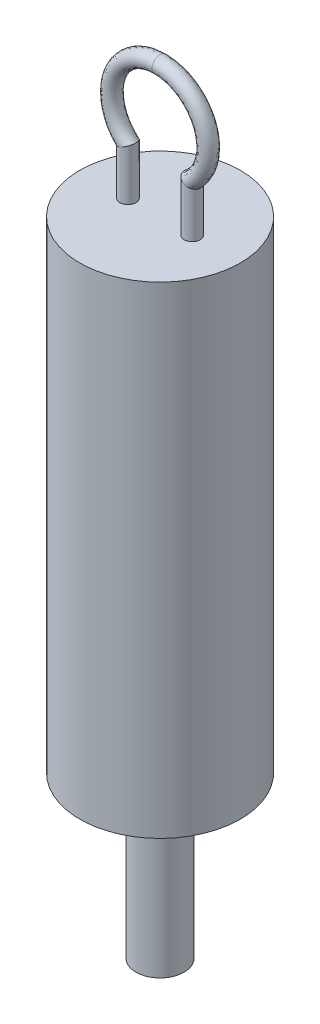
ISO-10303-21;
HEADER;
FILE_DESCRIPTION(('STEP AP214'),'2;1');
FILE_NAME('part.step','',(''),(''),'','','');
FILE_SCHEMA(('AUTOMOTIVE_DESIGN { 1 0 10303 214 1 1 1 1 }'));
ENDSEC;
DATA;
#1=APPLICATION_CONTEXT('core data for automotive mechanical design processes');
#2=APPLICATION_PROTOCOL_DEFINITION('international standard','automotive_design',2000,#1);
#3=PRODUCT_CONTEXT('',#1,'mechanical');
#4=PRODUCT('Part','Part','',(#3));
#5=PRODUCT_RELATED_PRODUCT_CATEGORY('part','',(#4));
#6=PRODUCT_DEFINITION_FORMATION('','',#4);
#7=PRODUCT_DEFINITION_CONTEXT('part definition',#1,'design');
#8=PRODUCT_DEFINITION('design','',#6,#7);
#9=PRODUCT_DEFINITION_SHAPE('','',#8);
#10=(LENGTH_UNIT() NAMED_UNIT(*) SI_UNIT(.MILLI.,.METRE.));
#11=(NAMED_UNIT(*) PLANE_ANGLE_UNIT() SI_UNIT($,.RADIAN.));
#12=(NAMED_UNIT(*) SI_UNIT($,.STERADIAN.) SOLID_ANGLE_UNIT());
#13=UNCERTAINTY_MEASURE_WITH_UNIT(LENGTH_MEASURE(1.E-05),#10,'distance_accuracy_value','');
#14=(GEOMETRIC_REPRESENTATION_CONTEXT(3) GLOBAL_UNCERTAINTY_ASSIGNED_CONTEXT((#13)) GLOBAL_UNIT_ASSIGNED_CONTEXT((#10,
#11,#12)) REPRESENTATION_CONTEXT('',''));
#15=CARTESIAN_POINT('',(0.,0.,0.));
#16=DIRECTION('',(0.,0.,1.));
#17=DIRECTION('',(1.,0.,0.));
#18=AXIS2_PLACEMENT_3D('',#15,#16,#17);
#19=CARTESIAN_POINT('',(0.,19.05,0.));
#20=DIRECTION('',(0.,1.,0.));
#21=DIRECTION('',(0.,0.,1.));
#22=AXIS2_PLACEMENT_3D('',#19,#20,#21);
#23=PLANE('',#22);
#24=CARTESIAN_POINT('',(0.,19.05,0.));
#25=DIRECTION('',(0.,1.,0.));
#26=DIRECTION('',(0.,0.,1.));
#27=AXIS2_PLACEMENT_3D('',#24,#25,#26);
#28=CIRCLE('',#27,6.35);
#29=CARTESIAN_POINT('',(0.,19.05,-6.35));
#30=VERTEX_POINT('',#29);
#31=EDGE_CURVE('E163',#30,#30,#28,.T.);
#32=ORIENTED_EDGE('',*,*,#31,.T.);
#33=EDGE_LOOP('',(#32));
#34=FACE_BOUND('',#33,.T.);
#35=CARTESIAN_POINT('',(2.54000000000001,19.05,0.));
#36=DIRECTION('',(0.,1.,0.));
#37=DIRECTION('',(0.,0.,1.));
#38=AXIS2_PLACEMENT_3D('',#35,#36,#37);
#39=CIRCLE('',#38,0.635);
#40=CARTESIAN_POINT('',(2.54000000000001,19.05,0.635));
#41=VERTEX_POINT('',#40);
#42=EDGE_CURVE('E48',#41,#41,#39,.T.);
#43=ORIENTED_EDGE('',*,*,#42,.F.);
#44=EDGE_LOOP('',(#43));
#45=FACE_BOUND('',#44,.T.);
#46=CARTESIAN_POINT('',(-2.54000000000001,19.05,0.));
#47=DIRECTION('',(0.,-1.,0.));
#48=DIRECTION('',(0.,0.,1.));
#49=AXIS2_PLACEMENT_3D('',#46,#47,#48);
#50=CIRCLE('',#49,0.635);
#51=CARTESIAN_POINT('',(-2.54000000000001,19.05,0.635));
#52=VERTEX_POINT('',#51);
#53=EDGE_CURVE('E71',#52,#52,#50,.T.);
#54=ORIENTED_EDGE('',*,*,#53,.T.);
#55=EDGE_LOOP('',(#54));
#56=FACE_BOUND('',#55,.T.);
#57=ADVANCED_FACE('F37',(#34,#45,#56),#23,.T.);
#58=CARTESIAN_POINT('',(0.,19.05,0.));
#59=DIRECTION('',(0.,-1.,0.));
#60=DIRECTION('',(0.,0.,-1.));
#61=AXIS2_PLACEMENT_3D('',#58,#59,#60);
#62=CYLINDRICAL_SURFACE('',#61,6.35);
#63=CARTESIAN_POINT('',(0.,-19.05,0.));
#64=DIRECTION('',(0.,1.,0.));
#65=DIRECTION('',(0.,0.,1.));
#66=AXIS2_PLACEMENT_3D('',#63,#64,#65);
#67=CIRCLE('',#66,6.35);
#68=CARTESIAN_POINT('',(0.,-19.05,-6.35));
#69=VERTEX_POINT('',#68);
#70=EDGE_CURVE('E41',#69,#69,#67,.T.);
#71=CARTESIAN_POINT('',(0.,19.05,-6.35));
#72=CARTESIAN_POINT('',(0.,18.653125,-6.35));
#73=CARTESIAN_POINT('',(0.,18.25625,-6.35));
#74=CARTESIAN_POINT('',(0.,17.4625,-6.35));
#75=CARTESIAN_POINT('',(0.,17.065625,-6.35));
#76=CARTESIAN_POINT('',(0.,16.271875,-6.35));
#77=CARTESIAN_POINT('',(0.,15.875,-6.35));
#78=CARTESIAN_POINT('',(0.,15.08125,-6.35));
#79=CARTESIAN_POINT('',(0.,14.684375,-6.35));
#80=CARTESIAN_POINT('',(0.,13.890625,-6.35));
#81=CARTESIAN_POINT('',(0.,13.49375,-6.35));
#82=CARTESIAN_POINT('',(0.,12.7,-6.35));
#83=CARTESIAN_POINT('',(0.,12.303125,-6.35));
#84=CARTESIAN_POINT('',(0.,11.509375,-6.35));
#85=CARTESIAN_POINT('',(0.,11.1125,-6.35));
#86=CARTESIAN_POINT('',(0.,10.31875,-6.35));
#87=CARTESIAN_POINT('',(0.,9.921875,-6.35));
#88=CARTESIAN_POINT('',(0.,9.128125,-6.35));
#89=CARTESIAN_POINT('',(0.,8.73125,-6.35));
#90=CARTESIAN_POINT('',(0.,7.9375,-6.35));
#91=CARTESIAN_POINT('',(0.,7.540625,-6.35));
#92=CARTESIAN_POINT('',(0.,6.746875,-6.35));
#93=CARTESIAN_POINT('',(0.,6.35,-6.35));
#94=CARTESIAN_POINT('',(0.,5.55625,-6.35));
#95=CARTESIAN_POINT('',(0.,5.159375,-6.35));
#96=CARTESIAN_POINT('',(0.,4.365625,-6.35));
#97=CARTESIAN_POINT('',(0.,3.96875,-6.35));
#98=CARTESIAN_POINT('',(0.,3.175,-6.35));
#99=CARTESIAN_POINT('',(0.,2.778125,-6.35));
#100=CARTESIAN_POINT('',(0.,1.984375,-6.35));
#101=CARTESIAN_POINT('',(0.,1.5875,-6.35));
#102=CARTESIAN_POINT('',(0.,0.793749999999997,-6.35));
#103=CARTESIAN_POINT('',(0.,0.396874999999997,-6.35));
#104=CARTESIAN_POINT('',(0.,-0.396875000000004,-6.35));
#105=CARTESIAN_POINT('',(0.,-0.793750000000004,-6.35));
#106=CARTESIAN_POINT('',(0.,-1.5875,-6.35));
#107=CARTESIAN_POINT('',(0.,-1.984375,-6.35));
#108=CARTESIAN_POINT('',(0.,-2.77812500000001,-6.35));
#109=CARTESIAN_POINT('',(0.,-3.17500000000001,-6.35));
#110=CARTESIAN_POINT('',(0.,-3.96875000000001,-6.35));
#111=CARTESIAN_POINT('',(0.,-4.36562500000001,-6.35));
#112=CARTESIAN_POINT('',(0.,-5.15937500000001,-6.35));
#113=CARTESIAN_POINT('',(0.,-5.55625,-6.35));
#114=CARTESIAN_POINT('',(0.,-6.35,-6.35));
#115=CARTESIAN_POINT('',(0.,-6.746875,-6.35));
#116=CARTESIAN_POINT('',(0.,-7.540625,-6.35));
#117=CARTESIAN_POINT('',(0.,-7.93750000000001,-6.35));
#118=CARTESIAN_POINT('',(0.,-8.73125,-6.35));
#119=CARTESIAN_POINT('',(0.,-9.12812500000001,-6.35));
#120=CARTESIAN_POINT('',(0.,-9.92187500000001,-6.35));
#121=CARTESIAN_POINT('',(0.,-10.31875,-6.35));
#122=CARTESIAN_POINT('',(0.,-11.1125,-6.35));
#123=CARTESIAN_POINT('',(0.,-11.509375,-6.35));
#124=CARTESIAN_POINT('',(0.,-12.303125,-6.35));
#125=CARTESIAN_POINT('',(0.,-12.7,-6.35));
#126=CARTESIAN_POINT('',(0.,-13.49375,-6.35));
#127=CARTESIAN_POINT('',(0.,-13.890625,-6.35));
#128=CARTESIAN_POINT('',(0.,-14.684375,-6.35));
#129=CARTESIAN_POINT('',(0.,-15.08125,-6.35));
#130=CARTESIAN_POINT('',(0.,-15.875,-6.35));
#131=CARTESIAN_POINT('',(0.,-16.271875,-6.35));
#132=CARTESIAN_POINT('',(0.,-17.065625,-6.35));
#133=CARTESIAN_POINT('',(0.,-17.4625,-6.35));
#134=CARTESIAN_POINT('',(0.,-18.25625,-6.35));
#135=CARTESIAN_POINT('',(0.,-18.653125,-6.35));
#136=CARTESIAN_POINT('',(0.,-19.05,-6.35));
#137=B_SPLINE_CURVE_WITH_KNOTS('',3,(#71,#72,#73,#74,#75,#76,#77,#78,#79,#80,#81,#82,#83,#84,
#85,#86,#87,#88,#89,#90,#91,#92,#93,#94,#95,#96,#97,#98,#99,#100,#101,#102,#103,#104,#105,#106,
#107,#108,#109,#110,#111,#112,#113,#114,#115,#116,#117,#118,#119,#120,#121,#122,#123,#124,#125,
#126,#127,#128,#129,#130,#131,#132,#133,#134,#135,#136),.UNSPECIFIED.,.F.,.F.,(4,2,2,2,2,2,2,2,
2,2,2,2,2,2,2,2,2,2,2,2,2,2,2,2,2,2,2,2,2,2,2,2,4),(0.,1.190625,2.38125,3.571875,4.7625,
5.953125,7.14375,8.334375,9.525,10.715625,11.90625,13.096875,14.2875,15.478125,16.66875,
17.859375,19.05,20.240625,21.43125,22.621875,23.8125,25.003125,26.19375,27.384375,28.575,
29.765625,30.95625,32.146875,33.3375,34.528125,35.71875,36.909375,38.1),.UNSPECIFIED.);
#138=EDGE_CURVE('BSEAM39',#30,#69,#137,.T.);
#139=ORIENTED_EDGE('',*,*,#31,.F.);
#140=ORIENTED_EDGE('',*,*,#70,.T.);
#141=ORIENTED_EDGE('',*,*,#138,.T.);
#142=ORIENTED_EDGE('',*,*,#138,.F.);
#143=EDGE_LOOP('',(#139,#141,#140,#142));
#144=FACE_BOUND('',#143,.T.);
#145=ADVANCED_FACE('F39',(#144),#62,.T.);
#146=CARTESIAN_POINT('',(0.,-19.05,0.));
#147=DIRECTION('',(0.,1.,0.));
#148=DIRECTION('',(0.,0.,1.));
#149=AXIS2_PLACEMENT_3D('',#146,#147,#148);
#150=PLANE('',#149);
#151=CARTESIAN_POINT('',(0.,-19.05,0.));
#152=DIRECTION('',(0.,-1.,0.));
#153=DIRECTION('',(0.,0.,-1.));
#154=AXIS2_PLACEMENT_3D('',#151,#152,#153);
#155=CIRCLE('',#154,1.905);
#156=CARTESIAN_POINT('',(0.,-19.05,-1.905));
#157=VERTEX_POINT('',#156);
#158=EDGE_CURVE('E11',#157,#157,#155,.T.);
#159=ORIENTED_EDGE('',*,*,#158,.F.);
#160=EDGE_LOOP('',(#159));
#161=FACE_BOUND('',#160,.T.);
#162=ORIENTED_EDGE('',*,*,#70,.F.);
#163=EDGE_LOOP('',(#162));
#164=FACE_BOUND('',#163,.T.);
#165=ADVANCED_FACE('F138',(#161,#164),#150,.F.);
#166=CARTESIAN_POINT('',(2.54000000000001,23.5847573929134,0.));
#167=DIRECTION('',(0.,-1.,0.));
#168=DIRECTION('',(1.,0.,0.));
#169=AXIS2_PLACEMENT_3D('',#166,#167,#168);
#170=CYLINDRICAL_SURFACE('',#169,0.635);
#171=CARTESIAN_POINT('',(2.54000000000001,22.86,0.635));
#172=CARTESIAN_POINT('',(2.5417762617346,22.8592056939995,0.635000024401584));
#173=CARTESIAN_POINT('',(2.54355281251543,22.8584115992909,0.634992569353515));
#174=CARTESIAN_POINT('',(2.58320646828637,22.8406945130085,0.63465924234807));
#175=CARTESIAN_POINT('',(2.62118626921693,22.8238794946618,0.630941380949673));
#176=CARTESIAN_POINT('',(2.69624168940151,22.7909407566076,0.616667526757757));
#177=CARTESIAN_POINT('',(2.73331455897619,22.7748190482006,0.606092904592829));
#178=CARTESIAN_POINT('',(2.80541551237144,22.7437071277409,0.578164972843541));
#179=CARTESIAN_POINT('',(2.84044076688117,22.7287184732941,0.560802527260201));
#180=CARTESIAN_POINT('',(2.90715312059628,22.7003558216726,0.519576296583897));
#181=CARTESIAN_POINT('',(2.93884224881534,22.6869808423383,0.49571649519286));
#182=CARTESIAN_POINT('',(2.99603208005988,22.6629712694886,0.443482413801477));
#183=CARTESIAN_POINT('',(3.02177627464647,22.6522268891861,0.415425947193239));
#184=CARTESIAN_POINT('',(3.06810668212686,22.6329680988542,0.354662629238486));
#185=CARTESIAN_POINT('',(3.08869519951567,22.6244526924362,0.321957865881212));
#186=CARTESIAN_POINT('',(3.12231553416214,22.6105869992732,0.255731152741505));
#187=CARTESIAN_POINT('',(3.13582798933738,22.6050346732854,0.222495271108779));
#188=CARTESIAN_POINT('',(3.15710154336905,22.5963068618709,0.153937923845985));
#189=CARTESIAN_POINT('',(3.16486534086789,22.5931302611797,0.118617445225148));
#190=CARTESIAN_POINT('',(3.17398244449658,22.5894012860362,0.0493332846319188));
#191=CARTESIAN_POINT('',(3.17571373678035,22.5886941709308,0.0154271574858905));
#192=CARTESIAN_POINT('',(3.17375382540068,22.5894952366635,-0.0521981893261221));
#193=CARTESIAN_POINT('',(3.17006359305542,22.5910030206811,-0.0859174413862339));
#194=CARTESIAN_POINT('',(3.15755503583175,22.596123167437,-0.151460447780435));
#195=CARTESIAN_POINT('',(3.14884892791208,22.599689479235,-0.183309390184283));
#196=CARTESIAN_POINT('',(3.12673622505351,22.60877183772,-0.245031761298978));
#197=CARTESIAN_POINT('',(3.11332926126458,22.6142880374041,-0.274905034771376));
#198=CARTESIAN_POINT('',(3.08191607576353,22.6272575250162,-0.332654413025495));
#199=CARTESIAN_POINT('',(3.06380465472233,22.6347551994067,-0.360463158837125));
#200=CARTESIAN_POINT('',(3.02378053768571,22.6513949996569,-0.412629384308462));
#201=CARTESIAN_POINT('',(3.00186728320762,22.6605373671263,-0.436986355952189));
#202=CARTESIAN_POINT('',(2.95349246767986,22.6808193662885,-0.483149024111544));
#203=CARTESIAN_POINT('',(2.92683625905899,22.6920462202413,-0.504712132315374));
#204=CARTESIAN_POINT('',(2.87080879449408,22.7157852119214,-0.543088219986048));
#205=CARTESIAN_POINT('',(2.84143607627701,22.7282980422863,-0.559898621128936));
#206=CARTESIAN_POINT('',(2.77841031607379,22.7553295665564,-0.589654632698633));
#207=CARTESIAN_POINT('',(2.74460204731609,22.7699285772706,-0.602197944849777));
#208=CARTESIAN_POINT('',(2.67574096290303,22.799908278992,-0.621348800972171));
#209=CARTESIAN_POINT('',(2.64069010724194,22.8152877541415,-0.627965295303968));
#210=CARTESIAN_POINT('',(2.58544773300116,22.8397354842024,-0.633691272983021));
#211=CARTESIAN_POINT('',(2.56538143712946,22.8486585934492,-0.634809350774308));
#212=CARTESIAN_POINT('',(2.54355292925709,22.8584115531879,-0.634992544276973));
#213=CARTESIAN_POINT('',(2.54177638216795,22.8592056466104,-0.63499999830559));
#214=CARTESIAN_POINT('',(2.54000000000001,22.86,-0.635));
#215=B_SPLINE_CURVE_WITH_KNOTS('',3,(#171,#172,#173,#174,#175,#176,#177,#178,#179,#180,#181,
#182,#183,#184,#185,#186,#187,#188,#189,#190,#191,#192,#193,#194,#195,#196,#197,#198,#199,#200,
#201,#202,#203,#204,#205,#206,#207,#208,#209,#210,#211,#212,#213,#214),.UNSPECIFIED.,.F.,.F.,(4,
2,2,2,2,2,2,2,2,2,2,2,2,2,2,2,2,2,2,2,2,4),(0.,0.00583782299000679,0.13028702502739,
0.255075772261387,0.380033059050468,0.50491390303172,0.622972868558221,0.740978969276307,
0.849324771267657,0.957619679244019,1.05899340390575,1.16034896870603,1.25952045888946,
1.35869973225039,1.4603231198001,1.56196144830659,1.6697319429329,1.77756079091257,
1.89377650832168,2.00981642569491,2.07570359676366,2.08154141975367),.UNSPECIFIED.);
#216=CARTESIAN_POINT('',(2.54000000000001,22.86,-0.635));
#217=VERTEX_POINT('',#216);
#218=CARTESIAN_POINT('',(2.54000000000001,22.86,0.635));
#219=VERTEX_POINT('',#218);
#220=EDGE_CURVE('E64',#217,#219,#215,.F.);
#221=ORIENTED_EDGE('',*,*,#220,.T.);
#222=CARTESIAN_POINT('',(2.54000000000001,22.86,0.635));
#223=CARTESIAN_POINT('',(2.53822373323266,22.8607943006918,0.635000024126427));
#224=CARTESIAN_POINT('',(2.53644730719633,22.8615886735953,0.63499256911555));
#225=CARTESIAN_POINT('',(2.49639201906643,22.8795004099037,0.634655893950714));
#226=CARTESIAN_POINT('',(2.45806775937698,22.8966385273824,0.630862715989782));
#227=CARTESIAN_POINT('',(2.3824480827654,22.9304553616155,0.616353128726087));
#228=CARTESIAN_POINT('',(2.34515586080193,22.9471326515496,0.605617287892937));
#229=CARTESIAN_POINT('',(2.2727281286195,22.9795231517025,0.577323450791784));
#230=CARTESIAN_POINT('',(2.23759487629499,22.9952353526038,0.55975844847671));
#231=CARTESIAN_POINT('',(2.1707309484083,23.0251382563761,0.51808838841208));
#232=CARTESIAN_POINT('',(2.13899816584733,23.039329901413,0.493987413555529));
#233=CARTESIAN_POINT('',(2.08165656904149,23.0649744640749,0.441122125938962));
#234=CARTESIAN_POINT('',(2.05581836746422,23.0765299663042,0.41265735007192));
#235=CARTESIAN_POINT('',(2.00940151704665,23.0972887620248,0.350966457772407));
#236=CARTESIAN_POINT('',(1.98882006690074,23.1064933083329,0.317742892078975));
#237=CARTESIAN_POINT('',(1.95551032655709,23.1213902545991,0.250734867799119));
#238=CARTESIAN_POINT('',(1.94223946197083,23.1273253088589,0.217273965901941));
#239=CARTESIAN_POINT('',(1.92150238300156,23.1365994293712,0.148261398687688));
#240=CARTESIAN_POINT('',(1.91403278024309,23.1399400109917,0.112710966886998));
#241=CARTESIAN_POINT('',(1.90560540508127,23.1437089302501,0.0434801033799612));
#242=CARTESIAN_POINT('',(1.90419197411378,23.1443410491395,0.00986547815742832));
#243=CARTESIAN_POINT('',(1.90668753030706,23.1432249783972,-0.0571218848077386));
#244=CARTESIAN_POINT('',(1.9105954651236,23.1414772593982,-0.0904946690644513));
#245=CARTESIAN_POINT('',(1.9233902941934,23.1357551095748,-0.155166103919272));
#246=CARTESIAN_POINT('',(1.93214658237951,23.1318390889591,-0.186496021904407));
#247=CARTESIAN_POINT('',(1.9541906968394,23.1219804243834,-0.24717356323395));
#248=CARTESIAN_POINT('',(1.96747883965358,23.1160376388581,-0.276521047938018));
#249=CARTESIAN_POINT('',(1.99858005949875,23.1021283927559,-0.333426666074763));
#250=CARTESIAN_POINT('',(2.01652118043685,23.094104667385,-0.360900598398968));
#251=CARTESIAN_POINT('',(2.05612348949918,23.07639350816,-0.412491441671907));
#252=CARTESIAN_POINT('',(2.07779233499084,23.0667026497367,-0.436601253773347));
#253=CARTESIAN_POINT('',(2.12809330140145,23.0442068182344,-0.484730955047846));
#254=CARTESIAN_POINT('',(2.15728356229481,23.0311522373535,-0.508052514646609));
#255=CARTESIAN_POINT('',(2.21876186772568,23.0036578342813,-0.548994297273048));
#256=CARTESIAN_POINT('',(2.25104674653484,22.9892194277156,-0.566620267738139));
#257=CARTESIAN_POINT('',(2.31784752926636,22.9593451927311,-0.595993575757162));
#258=CARTESIAN_POINT('',(2.35236850392521,22.9439070973706,-0.607726983634821));
#259=CARTESIAN_POINT('',(2.42260187024463,22.9124986476173,-0.625097796557308));
#260=CARTESIAN_POINT('',(2.45831157358959,22.8965294942873,-0.630748105654956));
#261=CARTESIAN_POINT('',(2.50765388638792,22.8744644360123,-0.634320125103719));
#262=CARTESIAN_POINT('',(2.52116090703693,22.868424374335,-0.634864301737218));
#263=CARTESIAN_POINT('',(2.5364471529278,22.8615887426003,-0.634992539048269));
#264=CARTESIAN_POINT('',(2.53822357205649,22.8607943727872,-0.6349999924133));
#265=CARTESIAN_POINT('',(2.54000000000001,22.86,-0.635));
#266=B_SPLINE_CURVE_WITH_KNOTS('',3,(#222,#223,#224,#225,#226,#227,#228,#229,#230,#231,#232,
#233,#234,#235,#236,#237,#238,#239,#240,#241,#242,#243,#244,#245,#246,#247,#248,#249,#250,#251,
#252,#253,#254,#255,#256,#257,#258,#259,#260,#261,#262,#263,#264,#265),.UNSPECIFIED.,.F.,.F.,(4,
2,2,2,2,2,2,2,2,2,2,2,2,2,2,2,2,2,2,2,2,4),(0.,0.00583782290694144,0.131625395834823,
0.257766563092617,0.384037481690915,0.510229702314528,0.630003492510459,0.749713321845819,
0.858576916677852,0.967376879022537,1.06782896387386,1.16826118637689,1.2661110277286,
1.36396770508362,1.46487224712364,1.56598659444087,1.68412203225437,1.80213788421342,
1.92043142083898,2.03847352440756,2.08287208718158,2.08870991008852),.UNSPECIFIED.);
#267=EDGE_CURVE('E66',#217,#219,#266,.F.);
#268=ORIENTED_EDGE('',*,*,#267,.F.);
#269=EDGE_LOOP('',(#221,#268));
#270=FACE_BOUND('',#269,.T.);
#271=ORIENTED_EDGE('',*,*,#42,.T.);
#272=EDGE_LOOP('',(#271));
#273=FACE_BOUND('',#272,.T.);
#274=ADVANCED_FACE('F73',(#270,#273),#170,.T.);
#275=CARTESIAN_POINT('',(0.,29.5098063314247,0.635));
#276=CARTESIAN_POINT('',(0.765767136662699,29.5098063314247,0.635));
#277=CARTESIAN_POINT('',(1.52987685121899,29.2721969890634,0.635));
#278=CARTESIAN_POINT('',(2.79133475263585,28.4036828983958,0.635));
#279=CARTESIAN_POINT('',(3.28595431788563,27.7746563046633,0.635));
#280=CARTESIAN_POINT('',(3.83243905741028,26.3439406822571,0.635));
#281=CARTESIAN_POINT('',(3.88312243084606,25.5453454323005,0.635));
#282=CARTESIAN_POINT('',(3.61220311972692,24.429102543119,0.635));
#283=CARTESIAN_POINT('',(3.46551882528698,24.0710388475526,0.635));
#284=CARTESIAN_POINT('',(3.1704723553201,23.5782842115129,0.635));
#285=CARTESIAN_POINT('',(3.05971289590431,23.4214482212837,0.635));
#286=CARTESIAN_POINT('',(2.87684222928725,23.1999976470247,0.635));
#287=CARTESIAN_POINT('',(2.81310055176628,23.1284771752583,0.635));
#288=CARTESIAN_POINT('',(2.68038754571279,22.9904169263671,0.635));
#289=CARTESIAN_POINT('',(2.61141252468659,22.9238817388801,0.635));
#290=CARTESIAN_POINT('',(2.44997165453126,22.7794655659874,0.635));
#291=CARTESIAN_POINT('',(2.35993257802767,22.6989428015747,0.635));
#292=CARTESIAN_POINT('',(2.17986515605569,22.5378856031497,0.635));
#293=CARTESIAN_POINT('',(2.08983144506966,22.4573570039361,0.635));
#294=CARTESIAN_POINT('',(1.99979773408336,22.3768284047244,0.635));
#295=CARTESIAN_POINT('',(0.,30.7798063314247,0.635));
#296=CARTESIAN_POINT('',(1.0210228488836,30.7798063314247,0.635));
#297=CARTESIAN_POINT('',(2.03983580162543,30.4629938749432,0.635));
#298=CARTESIAN_POINT('',(3.72177967018102,29.3049750873859,0.635));
#299=CARTESIAN_POINT('',(4.38127242384756,28.4662729624098,0.635));
#300=CARTESIAN_POINT('',(5.10991874321365,26.5586521325343,0.635));
#301=CARTESIAN_POINT('',(5.17749657446172,25.4938584659255,0.635));
#302=CARTESIAN_POINT('',(4.81627082630241,24.0055346136838,0.635));
#303=CARTESIAN_POINT('',(4.6206917670493,23.5281163529284,0.635));
#304=CARTESIAN_POINT('',(4.22729647376013,22.8711101715424,0.635));
#305=CARTESIAN_POINT('',(4.07961719453908,22.6619955179034,0.635));
#306=CARTESIAN_POINT('',(3.83578963904967,22.3667280855581,0.635));
#307=CARTESIAN_POINT('',(3.75080073568838,22.2713674565359,0.635));
#308=CARTESIAN_POINT('',(3.57385006095037,22.0872871246815,0.635));
#309=CARTESIAN_POINT('',(3.46998056945934,21.9879273562678,0.635));
#310=CARTESIAN_POINT('',(3.28163449120604,21.8194400773771,0.635));
#311=CARTESIAN_POINT('',(3.20659924469434,21.7523406910998,0.635));
#312=CARTESIAN_POINT('',(3.02653182272236,21.5912834926748,0.635));
#313=CARTESIAN_POINT('',(2.93649811173633,21.5107548934616,0.635));
#314=CARTESIAN_POINT('',(2.84646440075003,21.4302262942495,0.635));
#315=CARTESIAN_POINT('',(0.,30.7798063314247,-0.635));
#316=CARTESIAN_POINT('',(1.0210228488836,30.7798063314247,-0.635));
#317=CARTESIAN_POINT('',(2.03983580162543,30.4629938749432,-0.635));
#318=CARTESIAN_POINT('',(3.72177967018102,29.3049750873859,-0.635));
#319=CARTESIAN_POINT('',(4.38127242384756,28.4662729624098,-0.635));
#320=CARTESIAN_POINT('',(5.10991874321365,26.5586521325343,-0.635));
#321=CARTESIAN_POINT('',(5.17749657446172,25.4938584659255,-0.635));
#322=CARTESIAN_POINT('',(4.81627082630241,24.0055346136838,-0.635));
#323=CARTESIAN_POINT('',(4.6206917670493,23.5281163529284,-0.635));
#324=CARTESIAN_POINT('',(4.22729647376013,22.8711101715424,-0.635));
#325=CARTESIAN_POINT('',(4.07961719453908,22.6619955179034,-0.635));
#326=CARTESIAN_POINT('',(3.83578963904967,22.3667280855581,-0.635));
#327=CARTESIAN_POINT('',(3.75080073568838,22.2713674565359,-0.635));
#328=CARTESIAN_POINT('',(3.57385006095037,22.0872871246815,-0.635));
#329=CARTESIAN_POINT('',(3.46998056945934,21.9879273562678,-0.635));
#330=CARTESIAN_POINT('',(3.28163449120604,21.8194400773771,-0.635));
#331=CARTESIAN_POINT('',(3.20659924469434,21.7523406910998,-0.635));
#332=CARTESIAN_POINT('',(3.02653182272236,21.5912834926748,-0.635));
#333=CARTESIAN_POINT('',(2.93649811173633,21.5107548934616,-0.635));
#334=CARTESIAN_POINT('',(2.84646440075003,21.4302262942495,-0.635));
#335=CARTESIAN_POINT('',(0.,29.5098063314247,-0.635));
#336=CARTESIAN_POINT('',(0.765767136662699,29.5098063314247,-0.635));
#337=CARTESIAN_POINT('',(1.52987685121899,29.2721969890634,-0.635));
#338=CARTESIAN_POINT('',(2.79133475263585,28.4036828983958,-0.635));
#339=CARTESIAN_POINT('',(3.28595431788563,27.7746563046633,-0.635));
#340=CARTESIAN_POINT('',(3.83243905741028,26.3439406822571,-0.635));
#341=CARTESIAN_POINT('',(3.88312243084606,25.5453454323005,-0.635));
#342=CARTESIAN_POINT('',(3.61220311972692,24.429102543119,-0.635));
#343=CARTESIAN_POINT('',(3.46551882528698,24.0710388475526,-0.635));
#344=CARTESIAN_POINT('',(3.1704723553201,23.5782842115129,-0.635));
#345=CARTESIAN_POINT('',(3.05971289590431,23.4214482212837,-0.635));
#346=CARTESIAN_POINT('',(2.87684222928725,23.1999976470247,-0.635));
#347=CARTESIAN_POINT('',(2.81310055176628,23.1284771752583,-0.635));
#348=CARTESIAN_POINT('',(2.68038754571279,22.9904169263671,-0.635));
#349=CARTESIAN_POINT('',(2.61141252468659,22.9238817388801,-0.635));
#350=CARTESIAN_POINT('',(2.44997165453126,22.7794655659874,-0.635));
#351=CARTESIAN_POINT('',(2.35993257802767,22.6989428015747,-0.635));
#352=CARTESIAN_POINT('',(2.17986515605569,22.5378856031497,-0.635));
#353=CARTESIAN_POINT('',(2.08983144506966,22.4573570039361,-0.635));
#354=CARTESIAN_POINT('',(1.99979773408336,22.3768284047244,-0.635));
#355=CARTESIAN_POINT('',(0.,28.2398063314247,-0.635));
#356=CARTESIAN_POINT('',(0.5105114244418,28.2398063314247,-0.635));
#357=CARTESIAN_POINT('',(1.01991790081255,28.0814001031836,-0.635));
#358=CARTESIAN_POINT('',(1.86088983509068,27.5023907094057,-0.635));
#359=CARTESIAN_POINT('',(2.1906362119237,27.0830396469169,-0.635));
#360=CARTESIAN_POINT('',(2.55495937160691,26.1292292319799,-0.635));
#361=CARTESIAN_POINT('',(2.5887482872304,25.5968323986755,-0.635));
#362=CARTESIAN_POINT('',(2.40813541315144,24.8526704725541,-0.635));
#363=CARTESIAN_POINT('',(2.31034588352465,24.6139613421767,-0.635));
#364=CARTESIAN_POINT('',(2.11364823688007,24.2854582514835,-0.635));
#365=CARTESIAN_POINT('',(2.03980859726955,24.1809009246641,-0.635));
#366=CARTESIAN_POINT('',(1.91789481952484,24.0332672084914,-0.635));
#367=CARTESIAN_POINT('',(1.87540036784417,23.9855868939806,-0.635));
#368=CARTESIAN_POINT('',(1.78692503047521,23.8935467280528,-0.635));
#369=CARTESIAN_POINT('',(1.75284447991384,23.8598361214924,-0.635));
#370=CARTESIAN_POINT('',(1.61830881785647,23.7394910545977,-0.635));
#371=CARTESIAN_POINT('',(1.513265911361,23.6455449120496,-0.635));
#372=CARTESIAN_POINT('',(1.33319848938902,23.4844877136246,-0.635));
#373=CARTESIAN_POINT('',(1.24316477840299,23.4039591144105,-0.635));
#374=CARTESIAN_POINT('',(1.15313106741669,23.3234305151993,-0.635));
#375=CARTESIAN_POINT('',(0.,28.2398063314247,0.635));
#376=CARTESIAN_POINT('',(0.510511424441799,28.2398063314247,0.635));
#377=CARTESIAN_POINT('',(1.01991790081255,28.0814001031836,0.635));
#378=CARTESIAN_POINT('',(1.86088983509068,27.5023907094057,0.635));
#379=CARTESIAN_POINT('',(2.1906362119237,27.0830396469169,0.635));
#380=CARTESIAN_POINT('',(2.55495937160691,26.1292292319799,0.635));
#381=CARTESIAN_POINT('',(2.5887482872304,25.5968323986755,0.635));
#382=CARTESIAN_POINT('',(2.40813541315144,24.8526704725541,0.635));
#383=CARTESIAN_POINT('',(2.31034588352465,24.6139613421767,0.635));
#384=CARTESIAN_POINT('',(2.11364823688007,24.2854582514835,0.635));
#385=CARTESIAN_POINT('',(2.03980859726955,24.1809009246641,0.635));
#386=CARTESIAN_POINT('',(1.91789481952484,24.0332672084914,0.635));
#387=CARTESIAN_POINT('',(1.87540036784417,23.9855868939806,0.635));
#388=CARTESIAN_POINT('',(1.78692503047521,23.8935467280528,0.635));
#389=CARTESIAN_POINT('',(1.75284447991384,23.8598361214924,0.635));
#390=CARTESIAN_POINT('',(1.61830881785647,23.7394910545977,0.635));
#391=CARTESIAN_POINT('',(1.513265911361,23.6455449120496,0.635));
#392=CARTESIAN_POINT('',(1.33319848938902,23.4844877136246,0.635));
#393=CARTESIAN_POINT('',(1.24316477840299,23.4039591144105,0.635));
#394=CARTESIAN_POINT('',(1.15313106741669,23.3234305151993,0.635));
#395=CARTESIAN_POINT('',(0.,29.5098063314247,0.635));
#396=CARTESIAN_POINT('',(0.765767136662699,29.5098063314247,0.635));
#397=CARTESIAN_POINT('',(1.52987685121899,29.2721969890634,0.635));
#398=CARTESIAN_POINT('',(2.79133475263585,28.4036828983958,0.635));
#399=CARTESIAN_POINT('',(3.28595431788563,27.7746563046633,0.635));
#400=CARTESIAN_POINT('',(3.83243905741028,26.3439406822571,0.635));
#401=CARTESIAN_POINT('',(3.88312243084606,25.5453454323005,0.635));
#402=CARTESIAN_POINT('',(3.61220311972692,24.429102543119,0.635));
#403=CARTESIAN_POINT('',(3.46551882528698,24.0710388475526,0.635));
#404=CARTESIAN_POINT('',(3.1704723553201,23.5782842115129,0.635));
#405=CARTESIAN_POINT('',(3.05971289590431,23.4214482212837,0.635));
#406=CARTESIAN_POINT('',(2.87684222928725,23.1999976470247,0.635));
#407=CARTESIAN_POINT('',(2.81310055176628,23.1284771752583,0.635));
#408=CARTESIAN_POINT('',(2.68038754571279,22.9904169263671,0.635));
#409=CARTESIAN_POINT('',(2.61141252468659,22.9238817388801,0.635));
#410=CARTESIAN_POINT('',(2.44997165453126,22.7794655659874,0.635));
#411=CARTESIAN_POINT('',(2.35993257802767,22.6989428015747,0.635));
#412=CARTESIAN_POINT('',(2.17986515605569,22.5378856031497,0.635));
#413=CARTESIAN_POINT('',(2.08983144506966,22.4573570039361,0.635));
#414=CARTESIAN_POINT('',(1.99979773408336,22.3768284047244,0.635));
#415=(BOUNDED_SURFACE() B_SPLINE_SURFACE(3,3,((#275,#276,#277,#278,#279,#280,#281,#282,#283,
#284,#285,#286,#287,#288,#289,#290,#291,#292,#293,#294),(#295,#296,#297,#298,#299,#300,#301,
#302,#303,#304,#305,#306,#307,#308,#309,#310,#311,#312,#313,#314),(#315,#316,#317,#318,#319,
#320,#321,#322,#323,#324,#325,#326,#327,#328,#329,#330,#331,#332,#333,#334),(#335,#336,#337,
#338,#339,#340,#341,#342,#343,#344,#345,#346,#347,#348,#349,#350,#351,#352,#353,#354),(#355,
#356,#357,#358,#359,#360,#361,#362,#363,#364,#365,#366,#367,#368,#369,#370,#371,#372,#373,#374),
(#375,#376,#377,#378,#379,#380,#381,#382,#383,#384,#385,#386,#387,#388,#389,#390,#391,#392,#393,
#394),(#395,#396,#397,#398,#399,#400,#401,#402,#403,#404,#405,#406,#407,#408,#409,#410,#411,
#412,#413,#414)),.UNSPECIFIED.,.T.,.F.,.F.) B_SPLINE_SURFACE_WITH_KNOTS((4,3,4),(4,2,2,2,2,2,2,
2,2,4),(0.,0.5,1.),(0.5,0.625,0.75,0.875,0.9375,0.96875,0.984375,1.,1.01969812584169,
1.03939625168339),.UNSPECIFIED.) GEOMETRIC_REPRESENTATION_ITEM() RATIONAL_B_SPLINE_SURFACE(((1.,
1.,1.,1.,1.,1.,1.,1.,1.,1.,1.,1.,1.,1.,1.,1.,1.,1.,1.,1.),(0.333333333333333,0.333333333333333,
0.333333333333333,0.333333333333333,0.333333333333333,0.333333333333333,0.333333333333333,
0.333333333333333,0.333333333333333,0.333333333333333,0.333333333333333,0.333333333333333,
0.333333333333333,0.333333333333333,0.333333333333333,0.333333333333333,0.333333333333333,
0.333333333333333,0.333333333333333,0.333333333333333),(0.333333333333333,0.333333333333333,
0.333333333333333,0.333333333333333,0.333333333333333,0.333333333333333,0.333333333333333,
0.333333333333333,0.333333333333333,0.333333333333333,0.333333333333333,0.333333333333333,
0.333333333333333,0.333333333333333,0.333333333333333,0.333333333333333,0.333333333333333,
0.333333333333333,0.333333333333333,0.333333333333333),(1.,1.,1.,1.,1.,1.,1.,1.,1.,1.,1.,1.,1.,
1.,1.,1.,1.,1.,1.,1.),(0.333333333333333,0.333333333333333,0.333333333333333,0.333333333333333,
0.333333333333333,0.333333333333333,0.333333333333333,0.333333333333333,0.333333333333333,
0.333333333333333,0.333333333333333,0.333333333333333,0.333333333333333,0.333333333333333,
0.333333333333333,0.333333333333333,0.333333333333333,0.333333333333333,0.333333333333333,
0.333333333333333),(0.333333333333333,0.333333333333333,0.333333333333333,0.333333333333333,
0.333333333333333,0.333333333333333,0.333333333333333,0.333333333333333,0.333333333333333,
0.333333333333333,0.333333333333333,0.333333333333333,0.333333333333333,0.333333333333333,
0.333333333333333,0.333333333333333,0.333333333333333,0.333333333333333,0.333333333333333,
0.333333333333333),(1.,1.,1.,1.,1.,1.,1.,1.,1.,1.,1.,1.,1.,1.,1.,1.,1.,1.,1.,1.))) REPRESENTATION_ITEM('') SURFACE());
#416=CARTESIAN_POINT('',(0.,29.5098063314247,0.));
#417=DIRECTION('',(-1.,0.,0.));
#418=DIRECTION('',(0.,0.,1.));
#419=AXIS2_PLACEMENT_3D('',#416,#417,#418);
#420=CIRCLE('',#419,0.635);
#421=CARTESIAN_POINT('',(0.,29.5098063314247,0.635));
#422=VERTEX_POINT('',#421);
#423=EDGE_CURVE('E76',#422,#422,#420,.T.);
#424=ORIENTED_EDGE('',*,*,#267,.T.);
#425=ORIENTED_EDGE('',*,*,#220,.F.);
#426=EDGE_LOOP('',(#424,#425));
#427=FACE_BOUND('',#426,.T.);
#428=ORIENTED_EDGE('',*,*,#423,.F.);
#429=EDGE_LOOP('',(#428));
#430=FACE_BOUND('',#429,.T.);
#431=ADVANCED_FACE('F67',(#427,#430),#415,.F.);
#432=CARTESIAN_POINT('',(-1.99979773408335,22.3768284047244,0.635));
#433=CARTESIAN_POINT('',(-2.08983144506916,22.4573570039361,0.635));
#434=CARTESIAN_POINT('',(-2.17986515605564,22.5378856031496,0.635));
#435=CARTESIAN_POINT('',(-2.35993257802771,22.6989428015747,0.635));
#436=CARTESIAN_POINT('',(-2.44997165453142,22.7794655659876,0.635));
#437=CARTESIAN_POINT('',(-2.61141252468645,22.9238817388799,0.635));
#438=CARTESIAN_POINT('',(-2.68038754571309,22.9904169263677,0.635));
#439=CARTESIAN_POINT('',(-2.81310055176596,23.1284771752577,0.635));
#440=CARTESIAN_POINT('',(-2.87684222928696,23.1999976470241,0.635));
#441=CARTESIAN_POINT('',(-3.0597128959049,23.4214482212849,0.635));
#442=CARTESIAN_POINT('',(-3.17047235532015,23.5782842115137,0.635));
#443=CARTESIAN_POINT('',(-3.46551882528687,24.0710388475511,0.635));
#444=CARTESIAN_POINT('',(-3.61220311972709,24.429102543119,0.635));
#445=CARTESIAN_POINT('',(-3.88312243084573,25.5453454323005,0.635));
#446=CARTESIAN_POINT('',(-3.83243905741061,26.3439406822571,0.635));
#447=CARTESIAN_POINT('',(-3.2859543178853,27.7746563046633,0.635));
#448=CARTESIAN_POINT('',(-2.79133475263452,28.4036828983971,0.635));
#449=CARTESIAN_POINT('',(-1.52987685122032,29.2721969890621,0.635));
#450=CARTESIAN_POINT('',(-0.765767136662699,29.5098063314247,0.635));
#451=CARTESIAN_POINT('',(0.,29.5098063314247,0.635));
#452=CARTESIAN_POINT('',(-2.84646440075001,21.4302262942495,0.635));
#453=CARTESIAN_POINT('',(-2.93649811173583,21.5107548934612,0.635));
#454=CARTESIAN_POINT('',(-3.02653182272231,21.5912834926747,0.635));
#455=CARTESIAN_POINT('',(-3.20659924469437,21.7523406910998,0.635));
#456=CARTESIAN_POINT('',(-3.2816344912062,21.8194400773773,0.635));
#457=CARTESIAN_POINT('',(-3.4699805694592,21.9879273562676,0.635));
#458=CARTESIAN_POINT('',(-3.57385006095082,22.087287124682,0.635));
#459=CARTESIAN_POINT('',(-3.75080073568792,22.2713674565354,0.635));
#460=CARTESIAN_POINT('',(-3.83578963904934,22.3667280855573,0.635));
#461=CARTESIAN_POINT('',(-4.07961719453972,22.6619955179049,0.635));
#462=CARTESIAN_POINT('',(-4.22729647376015,22.8711101715431,0.635));
#463=CARTESIAN_POINT('',(-4.62069176704925,23.5281163529269,0.635));
#464=CARTESIAN_POINT('',(-4.81627082630278,24.0055346136841,0.635));
#465=CARTESIAN_POINT('',(-5.17749657446096,25.4938584659248,0.635));
#466=CARTESIAN_POINT('',(-5.10991874321381,26.5586521325343,0.635));
#467=CARTESIAN_POINT('',(-4.38127242384739,28.4662729624098,0.635));
#468=CARTESIAN_POINT('',(-3.7217796701787,29.3049750873879,0.635));
#469=CARTESIAN_POINT('',(-2.03983580162776,30.4629938749412,0.635));
#470=CARTESIAN_POINT('',(-1.0210228488836,30.7798063314247,0.635));
#471=CARTESIAN_POINT('',(0.,30.7798063314247,0.635));
#472=CARTESIAN_POINT('',(-2.84646440075001,21.4302262942495,-0.635));
#473=CARTESIAN_POINT('',(-2.93649811173583,21.5107548934612,-0.635));
#474=CARTESIAN_POINT('',(-3.02653182272231,21.5912834926747,-0.635));
#475=CARTESIAN_POINT('',(-3.20659924469437,21.7523406910998,-0.635));
#476=CARTESIAN_POINT('',(-3.2816344912062,21.8194400773773,-0.635));
#477=CARTESIAN_POINT('',(-3.4699805694592,21.9879273562676,-0.635));
#478=CARTESIAN_POINT('',(-3.57385006095082,22.087287124682,-0.635));
#479=CARTESIAN_POINT('',(-3.75080073568792,22.2713674565354,-0.635));
#480=CARTESIAN_POINT('',(-3.83578963904934,22.3667280855573,-0.635));
#481=CARTESIAN_POINT('',(-4.07961719453972,22.6619955179049,-0.635));
#482=CARTESIAN_POINT('',(-4.22729647376015,22.8711101715431,-0.635));
#483=CARTESIAN_POINT('',(-4.62069176704925,23.5281163529269,-0.635));
#484=CARTESIAN_POINT('',(-4.81627082630278,24.0055346136841,-0.635));
#485=CARTESIAN_POINT('',(-5.17749657446096,25.4938584659248,-0.635));
#486=CARTESIAN_POINT('',(-5.10991874321381,26.5586521325343,-0.635));
#487=CARTESIAN_POINT('',(-4.38127242384739,28.4662729624098,-0.635));
#488=CARTESIAN_POINT('',(-3.7217796701787,29.3049750873879,-0.635));
#489=CARTESIAN_POINT('',(-2.03983580162776,30.4629938749412,-0.635));
#490=CARTESIAN_POINT('',(-1.0210228488836,30.7798063314247,-0.635));
#491=CARTESIAN_POINT('',(0.,30.7798063314247,-0.635));
#492=CARTESIAN_POINT('',(-1.99979773408335,22.3768284047244,-0.635));
#493=CARTESIAN_POINT('',(-2.08983144506916,22.4573570039361,-0.635));
#494=CARTESIAN_POINT('',(-2.17986515605564,22.5378856031496,-0.635));
#495=CARTESIAN_POINT('',(-2.35993257802771,22.6989428015747,-0.635));
#496=CARTESIAN_POINT('',(-2.44997165453142,22.7794655659876,-0.635));
#497=CARTESIAN_POINT('',(-2.61141252468645,22.9238817388799,-0.635));
#498=CARTESIAN_POINT('',(-2.68038754571309,22.9904169263677,-0.635));
#499=CARTESIAN_POINT('',(-2.81310055176596,23.1284771752577,-0.635));
#500=CARTESIAN_POINT('',(-2.87684222928696,23.1999976470241,-0.635));
#501=CARTESIAN_POINT('',(-3.0597128959049,23.4214482212849,-0.635));
#502=CARTESIAN_POINT('',(-3.17047235532015,23.5782842115137,-0.635));
#503=CARTESIAN_POINT('',(-3.46551882528687,24.0710388475511,-0.635));
#504=CARTESIAN_POINT('',(-3.61220311972709,24.429102543119,-0.635));
#505=CARTESIAN_POINT('',(-3.88312243084573,25.5453454323005,-0.635));
#506=CARTESIAN_POINT('',(-3.83243905741061,26.3439406822571,-0.635));
#507=CARTESIAN_POINT('',(-3.2859543178853,27.7746563046633,-0.635));
#508=CARTESIAN_POINT('',(-2.79133475263452,28.4036828983971,-0.635));
#509=CARTESIAN_POINT('',(-1.52987685122032,29.2721969890621,-0.635));
#510=CARTESIAN_POINT('',(-0.765767136662699,29.5098063314247,-0.635));
#511=CARTESIAN_POINT('',(0.,29.5098063314247,-0.635));
#512=CARTESIAN_POINT('',(-1.15313106741668,23.3234305151993,-0.635));
#513=CARTESIAN_POINT('',(-1.2431647784025,23.403959114411,-0.635));
#514=CARTESIAN_POINT('',(-1.33319848938898,23.4844877136246,-0.635));
#515=CARTESIAN_POINT('',(-1.51326591136104,23.6455449120496,-0.635));
#516=CARTESIAN_POINT('',(-1.61830881785664,23.7394910545979,-0.635));
#517=CARTESIAN_POINT('',(-1.75284447991369,23.8598361214923,-0.635));
#518=CARTESIAN_POINT('',(-1.78692503047537,23.8935467280534,-0.635));
#519=CARTESIAN_POINT('',(-1.875400367844,23.98558689398,-0.635));
#520=CARTESIAN_POINT('',(-1.91789481952457,24.0332672084909,-0.635));
#521=CARTESIAN_POINT('',(-2.03980859727007,24.180900924665,-0.635));
#522=CARTESIAN_POINT('',(-2.11364823688014,24.2854582514842,-0.635));
#523=CARTESIAN_POINT('',(-2.3103458835245,24.6139613421753,-0.635));
#524=CARTESIAN_POINT('',(-2.40813541315139,24.8526704725538,-0.635));
#525=CARTESIAN_POINT('',(-2.58874828723049,25.5968323986761,-0.635));
#526=CARTESIAN_POINT('',(-2.55495937160741,26.1292292319799,-0.635));
#527=CARTESIAN_POINT('',(-2.1906362119232,27.0830396469169,-0.635));
#528=CARTESIAN_POINT('',(-1.86088983509035,27.5023907094063,-0.635));
#529=CARTESIAN_POINT('',(-1.01991790081288,28.081400103183,-0.635));
#530=CARTESIAN_POINT('',(-0.5105114244418,28.2398063314247,-0.635));
#531=CARTESIAN_POINT('',(0.,28.2398063314247,-0.635));
#532=CARTESIAN_POINT('',(-1.15313106741668,23.3234305151993,0.635));
#533=CARTESIAN_POINT('',(-1.2431647784025,23.403959114411,0.635));
#534=CARTESIAN_POINT('',(-1.33319848938898,23.4844877136246,0.635));
#535=CARTESIAN_POINT('',(-1.51326591136104,23.6455449120496,0.635));
#536=CARTESIAN_POINT('',(-1.61830881785664,23.7394910545979,0.635));
#537=CARTESIAN_POINT('',(-1.75284447991369,23.8598361214923,0.635));
#538=CARTESIAN_POINT('',(-1.78692503047537,23.8935467280534,0.635));
#539=CARTESIAN_POINT('',(-1.875400367844,23.98558689398,0.635));
#540=CARTESIAN_POINT('',(-1.91789481952457,24.0332672084909,0.635));
#541=CARTESIAN_POINT('',(-2.03980859727007,24.180900924665,0.635));
#542=CARTESIAN_POINT('',(-2.11364823688014,24.2854582514842,0.635));
#543=CARTESIAN_POINT('',(-2.3103458835245,24.6139613421753,0.635));
#544=CARTESIAN_POINT('',(-2.40813541315139,24.8526704725538,0.635));
#545=CARTESIAN_POINT('',(-2.58874828723049,25.5968323986761,0.635));
#546=CARTESIAN_POINT('',(-2.55495937160741,26.1292292319799,0.635));
#547=CARTESIAN_POINT('',(-2.1906362119232,27.0830396469169,0.635));
#548=CARTESIAN_POINT('',(-1.86088983509035,27.5023907094063,0.635));
#549=CARTESIAN_POINT('',(-1.01991790081288,28.081400103183,0.635));
#550=CARTESIAN_POINT('',(-0.510511424441799,28.2398063314247,0.635));
#551=CARTESIAN_POINT('',(0.,28.2398063314247,0.635));
#552=CARTESIAN_POINT('',(-1.99979773408335,22.3768284047244,0.635));
#553=CARTESIAN_POINT('',(-2.08983144506916,22.4573570039361,0.635));
#554=CARTESIAN_POINT('',(-2.17986515605564,22.5378856031496,0.635));
#555=CARTESIAN_POINT('',(-2.35993257802771,22.6989428015747,0.635));
#556=CARTESIAN_POINT('',(-2.44997165453142,22.7794655659876,0.635));
#557=CARTESIAN_POINT('',(-2.61141252468645,22.9238817388799,0.635));
#558=CARTESIAN_POINT('',(-2.68038754571309,22.9904169263677,0.635));
#559=CARTESIAN_POINT('',(-2.81310055176596,23.1284771752577,0.635));
#560=CARTESIAN_POINT('',(-2.87684222928696,23.1999976470241,0.635));
#561=CARTESIAN_POINT('',(-3.0597128959049,23.4214482212849,0.635));
#562=CARTESIAN_POINT('',(-3.17047235532015,23.5782842115137,0.635));
#563=CARTESIAN_POINT('',(-3.46551882528687,24.0710388475511,0.635));
#564=CARTESIAN_POINT('',(-3.61220311972709,24.429102543119,0.635));
#565=CARTESIAN_POINT('',(-3.88312243084573,25.5453454323005,0.635));
#566=CARTESIAN_POINT('',(-3.83243905741061,26.3439406822571,0.635));
#567=CARTESIAN_POINT('',(-3.2859543178853,27.7746563046633,0.635));
#568=CARTESIAN_POINT('',(-2.79133475263452,28.4036828983971,0.635));
#569=CARTESIAN_POINT('',(-1.52987685122032,29.2721969890621,0.635));
#570=CARTESIAN_POINT('',(-0.765767136662699,29.5098063314247,0.635));
#571=CARTESIAN_POINT('',(0.,29.5098063314247,0.635));
#572=(BOUNDED_SURFACE() B_SPLINE_SURFACE(3,3,((#432,#433,#434,#435,#436,#437,#438,#439,#440,
#441,#442,#443,#444,#445,#446,#447,#448,#449,#450,#451),(#452,#453,#454,#455,#456,#457,#458,
#459,#460,#461,#462,#463,#464,#465,#466,#467,#468,#469,#470,#471),(#472,#473,#474,#475,#476,
#477,#478,#479,#480,#481,#482,#483,#484,#485,#486,#487,#488,#489,#490,#491),(#492,#493,#494,
#495,#496,#497,#498,#499,#500,#501,#502,#503,#504,#505,#506,#507,#508,#509,#510,#511),(#512,
#513,#514,#515,#516,#517,#518,#519,#520,#521,#522,#523,#524,#525,#526,#527,#528,#529,#530,#531),
(#532,#533,#534,#535,#536,#537,#538,#539,#540,#541,#542,#543,#544,#545,#546,#547,#548,#549,#550,
#551),(#552,#553,#554,#555,#556,#557,#558,#559,#560,#561,#562,#563,#564,#565,#566,#567,#568,
#569,#570,#571)),.UNSPECIFIED.,.T.,.F.,.F.) B_SPLINE_SURFACE_WITH_KNOTS((4,3,4),(4,2,2,2,2,2,2,
2,2,4),(0.,0.5,1.),(-0.0393962516833879,-0.019698125841694,0.,0.015625,0.03125,0.0625,0.125,
0.25,0.375,0.5),.UNSPECIFIED.) GEOMETRIC_REPRESENTATION_ITEM() RATIONAL_B_SPLINE_SURFACE(((1.,
1.,1.,1.,1.,1.,1.,1.,1.,1.,1.,1.,1.,1.,1.,1.,1.,1.,1.,1.),(0.333333333333333,0.333333333333333,
0.333333333333333,0.333333333333333,0.333333333333333,0.333333333333333,0.333333333333333,
0.333333333333333,0.333333333333333,0.333333333333333,0.333333333333333,0.333333333333333,
0.333333333333333,0.333333333333333,0.333333333333333,0.333333333333333,0.333333333333333,
0.333333333333333,0.333333333333333,0.333333333333333),(0.333333333333333,0.333333333333333,
0.333333333333333,0.333333333333333,0.333333333333333,0.333333333333333,0.333333333333333,
0.333333333333333,0.333333333333333,0.333333333333333,0.333333333333333,0.333333333333333,
0.333333333333333,0.333333333333333,0.333333333333333,0.333333333333333,0.333333333333333,
0.333333333333333,0.333333333333333,0.333333333333333),(1.,1.,1.,1.,1.,1.,1.,1.,1.,1.,1.,1.,1.,
1.,1.,1.,1.,1.,1.,1.),(0.333333333333333,0.333333333333333,0.333333333333333,0.333333333333333,
0.333333333333333,0.333333333333333,0.333333333333333,0.333333333333333,0.333333333333333,
0.333333333333333,0.333333333333333,0.333333333333333,0.333333333333333,0.333333333333333,
0.333333333333333,0.333333333333333,0.333333333333333,0.333333333333333,0.333333333333333,
0.333333333333333),(0.333333333333333,0.333333333333333,0.333333333333333,0.333333333333333,
0.333333333333333,0.333333333333333,0.333333333333333,0.333333333333333,0.333333333333333,
0.333333333333333,0.333333333333333,0.333333333333333,0.333333333333333,0.333333333333333,
0.333333333333333,0.333333333333333,0.333333333333333,0.333333333333333,0.333333333333333,
0.333333333333333),(1.,1.,1.,1.,1.,1.,1.,1.,1.,1.,1.,1.,1.,1.,1.,1.,1.,1.,1.,1.))) REPRESENTATION_ITEM('') SURFACE());
#573=CARTESIAN_POINT('',(-2.54000000000001,22.8599999999996,0.635000000000001));
#574=CARTESIAN_POINT('',(-2.54177626173464,22.8592056939991,0.635000024401584));
#575=CARTESIAN_POINT('',(-2.54355281251552,22.8584115992907,0.634992569353514));
#576=CARTESIAN_POINT('',(-2.58320646828741,22.8406945130103,0.634659242348047));
#577=CARTESIAN_POINT('',(-2.62118626921739,22.8238794946622,0.630941380949607));
#578=CARTESIAN_POINT('',(-2.6962416894016,22.790940756607,0.616667526757718));
#579=CARTESIAN_POINT('',(-2.7333145589765,22.7748190482003,0.60609290459286));
#580=CARTESIAN_POINT('',(-2.8054155123719,22.7437071277409,0.57816497284351));
#581=CARTESIAN_POINT('',(-2.84044076688157,22.728718473294,0.560802527260036));
#582=CARTESIAN_POINT('',(-2.90715312059667,22.7003558216724,0.519576296583571));
#583=CARTESIAN_POINT('',(-2.93884224881576,22.6869808423382,0.495716495192505));
#584=CARTESIAN_POINT('',(-2.99603208006031,22.6629712694886,0.443482413801053));
#585=CARTESIAN_POINT('',(-3.02177627464687,22.652226889186,0.415425947192783));
#586=CARTESIAN_POINT('',(-3.06810668212719,22.6329680988542,0.354662629237985));
#587=CARTESIAN_POINT('',(-3.08869519951597,22.6244526924362,0.321957865880701));
#588=CARTESIAN_POINT('',(-3.12231553416238,22.6105869992731,0.255731152740971));
#589=CARTESIAN_POINT('',(-3.13582798933758,22.6050346732854,0.222495271108234));
#590=CARTESIAN_POINT('',(-3.15710154336919,22.5963068618709,0.153937923845424));
#591=CARTESIAN_POINT('',(-3.16486534086799,22.5931302611797,0.11861744522458));
#592=CARTESIAN_POINT('',(-3.17398244449662,22.5894012860362,0.0493332846313482));
#593=CARTESIAN_POINT('',(-3.17571373678036,22.5886941709309,0.015427157485323));
#594=CARTESIAN_POINT('',(-3.17375382540063,22.5894952366635,-0.0521981893266747));
#595=CARTESIAN_POINT('',(-3.17006359305534,22.5910030206812,-0.0859174413867747));
#596=CARTESIAN_POINT('',(-3.15755503583162,22.5961231674371,-0.151460447780949));
#597=CARTESIAN_POINT('',(-3.14884892791192,22.5996894792351,-0.183309390184783));
#598=CARTESIAN_POINT('',(-3.12673622505331,22.6087718377201,-0.245031761299452));
#599=CARTESIAN_POINT('',(-3.11332926126436,22.6142880374043,-0.274905034771838));
#600=CARTESIAN_POINT('',(-3.08191607576325,22.6272575250163,-0.332654413025938));
#601=CARTESIAN_POINT('',(-3.06380465472203,22.6347551994069,-0.36046315883756));
#602=CARTESIAN_POINT('',(-3.02378053768536,22.6513949996571,-0.412629384308864));
#603=CARTESIAN_POINT('',(-3.00186728320726,22.6605373671265,-0.436986355952569));
#604=CARTESIAN_POINT('',(-2.95349246767946,22.6808193662887,-0.483149024111882));
#605=CARTESIAN_POINT('',(-2.92683625905856,22.6920462202415,-0.504712132315688));
#606=CARTESIAN_POINT('',(-2.8708087944936,22.7157852119217,-0.543088219986358));
#607=CARTESIAN_POINT('',(-2.84143607627652,22.7282980422865,-0.55989862112927));
#608=CARTESIAN_POINT('',(-2.77841031607321,22.7553295665567,-0.589654632698797));
#609=CARTESIAN_POINT('',(-2.74460204731542,22.7699285772709,-0.602197944849718));
#610=CARTESIAN_POINT('',(-2.67574096290234,22.7999082789923,-0.621348800972606));
#611=CARTESIAN_POINT('',(-2.64069010724132,22.8152877541417,-0.627965295305132));
#612=CARTESIAN_POINT('',(-2.58544773300081,22.8397354842027,-0.633691272983619));
#613=CARTESIAN_POINT('',(-2.56538143712933,22.8486585934495,-0.63480935077436));
#614=CARTESIAN_POINT('',(-2.5435529292571,22.8584115531879,-0.63499254427697));
#615=CARTESIAN_POINT('',(-2.54177638216796,22.8592056466104,-0.634999998305586));
#616=CARTESIAN_POINT('',(-2.54000000000001,22.86,-0.635));
#617=B_SPLINE_CURVE_WITH_KNOTS('',3,(#573,#574,#575,#576,#577,#578,#579,#580,#581,#582,#583,
#584,#585,#586,#587,#588,#589,#590,#591,#592,#593,#594,#595,#596,#597,#598,#599,#600,#601,#602,
#603,#604,#605,#606,#607,#608,#609,#610,#611,#612,#613,#614,#615,#616),.UNSPECIFIED.,.F.,.F.,(4,
2,2,2,2,2,2,2,2,2,2,2,2,2,2,2,2,2,2,2,2,4),(0.,0.00583782299000461,0.130287025027517,
0.255075772261598,0.380033059050782,0.504913903032162,0.62297286855866,0.740978969276723,
0.849324771268061,0.957619679244418,1.05899340390613,1.16034896870639,1.2595204588898,
1.35869973225074,1.46032311980049,1.56196144830695,1.66973194293332,1.777560790913,
1.8937765083223,2.00981642569548,2.07570359676355,2.08154141975356),.UNSPECIFIED.);
#618=CARTESIAN_POINT('',(-2.54000000000001,22.86,-0.635));
#619=VERTEX_POINT('',#618);
#620=CARTESIAN_POINT('',(-2.54000000000001,22.8599999999996,0.635000000000001));
#621=VERTEX_POINT('',#620);
#622=EDGE_CURVE('E118',#619,#621,#617,.F.);
#623=CARTESIAN_POINT('',(-2.54000000000001,22.8599999999996,0.635000000000001));
#624=CARTESIAN_POINT('',(-2.53822373323272,22.8607943006915,0.635000024126429));
#625=CARTESIAN_POINT('',(-2.53644730719644,22.8615886735951,0.634992569115552));
#626=CARTESIAN_POINT('',(-2.49639201906765,22.8795004099062,0.634655893950702));
#627=CARTESIAN_POINT('',(-2.45806775937745,22.8966385273831,0.630862715989473));
#628=CARTESIAN_POINT('',(-2.38244808276502,22.9304553616148,0.616353128726416));
#629=CARTESIAN_POINT('',(-2.34515586080145,22.9471326515494,0.605617287894213));
#630=CARTESIAN_POINT('',(-2.27272812861929,22.9795231517026,0.577323450793132));
#631=CARTESIAN_POINT('',(-2.23759487629513,22.9952353526037,0.559758448477182));
#632=CARTESIAN_POINT('',(-2.17073094840864,23.0251382563759,0.51808838841191));
#633=CARTESIAN_POINT('',(-2.13899816584751,23.0393299014129,0.493987413555574));
#634=CARTESIAN_POINT('',(-2.08165656904153,23.0649744640749,0.441122125939128));
#635=CARTESIAN_POINT('',(-2.05581836746427,23.0765299663042,0.412657350072012));
#636=CARTESIAN_POINT('',(-2.00940151704671,23.0972887620248,0.350966457772459));
#637=CARTESIAN_POINT('',(-1.9888200669008,23.1064933083329,0.317742892079065));
#638=CARTESIAN_POINT('',(-1.95551032655714,23.1213902545991,0.250734867799254));
#639=CARTESIAN_POINT('',(-1.94223946197088,23.1273253088589,0.217273965902083));
#640=CARTESIAN_POINT('',(-1.92150238300159,23.1365994293711,0.148261398687829));
#641=CARTESIAN_POINT('',(-1.91403278024311,23.1399400109917,0.112710966887131));
#642=CARTESIAN_POINT('',(-1.90560540508128,23.1437089302501,0.0434801033800812));
#643=CARTESIAN_POINT('',(-1.90419197411378,23.1443410491395,0.00986547815754458));
#644=CARTESIAN_POINT('',(-1.90668753030705,23.1432249783973,-0.0571218848076247));
#645=CARTESIAN_POINT('',(-1.91059546512359,23.1414772593982,-0.0904946690643361));
#646=CARTESIAN_POINT('',(-1.92339029419338,23.1357551095748,-0.155166103919157));
#647=CARTESIAN_POINT('',(-1.93214658237948,23.1318390889591,-0.186496021904295));
#648=CARTESIAN_POINT('',(-1.95419069683936,23.1219804243834,-0.247173563233844));
#649=CARTESIAN_POINT('',(-1.96747883965353,23.1160376388582,-0.276521047937916));
#650=CARTESIAN_POINT('',(-1.99858005949869,23.1021283927559,-0.333426666074668));
#651=CARTESIAN_POINT('',(-2.01652118043678,23.0941046673851,-0.360900598398877));
#652=CARTESIAN_POINT('',(-2.0561234894991,23.07639350816,-0.412491441671824));
#653=CARTESIAN_POINT('',(-2.07779233499076,23.0667026497368,-0.43660125377327));
#654=CARTESIAN_POINT('',(-2.12809330140136,23.0442068182344,-0.484730955047774));
#655=CARTESIAN_POINT('',(-2.15728356229471,23.0311522373536,-0.508052514646537));
#656=CARTESIAN_POINT('',(-2.21876186772556,23.0036578342813,-0.54899429727298));
#657=CARTESIAN_POINT('',(-2.25104674653473,22.9892194277157,-0.566620267738075));
#658=CARTESIAN_POINT('',(-2.31784752926624,22.9593451927312,-0.595993575757111));
#659=CARTESIAN_POINT('',(-2.35236850392508,22.9439070973706,-0.60772698363478));
#660=CARTESIAN_POINT('',(-2.42260187024449,22.9124986476174,-0.625097796557282));
#661=CARTESIAN_POINT('',(-2.45831157358944,22.8965294942874,-0.630748105654936));
#662=CARTESIAN_POINT('',(-2.50765388638783,22.8744644360123,-0.634320125103715));
#663=CARTESIAN_POINT('',(-2.52116090703688,22.868424374335,-0.634864301737218));
#664=CARTESIAN_POINT('',(-2.5364471529278,22.8615887426003,-0.634992539048269));
#665=CARTESIAN_POINT('',(-2.53822357205649,22.8607943727872,-0.6349999924133));
#666=CARTESIAN_POINT('',(-2.54000000000001,22.86,-0.635));
#667=B_SPLINE_CURVE_WITH_KNOTS('',3,(#623,#624,#625,#626,#627,#628,#629,#630,#631,#632,#633,
#634,#635,#636,#637,#638,#639,#640,#641,#642,#643,#644,#645,#646,#647,#648,#649,#650,#651,#652,
#653,#654,#655,#656,#657,#658,#659,#660,#661,#662,#663,#664,#665,#666),.UNSPECIFIED.,.F.,.F.,(4,
2,2,2,2,2,2,2,2,2,2,2,2,2,2,2,2,2,2,2,2,4),(0.,0.00583782290694095,0.131625395834979,
0.257766563092751,0.384037481690971,0.510229702314792,0.630003492510799,0.749713321846092,
0.858576916678103,0.967376879022822,1.06782896387416,1.16826118637719,1.26611102772889,
1.36396770508391,1.46487224712394,1.56598659444117,1.68412203225465,1.80213788421369,
1.92043142083924,2.03847352440782,2.082872087182,2.08870991008893),.UNSPECIFIED.);
#668=EDGE_CURVE('E56',#619,#621,#667,.F.);
#669=ORIENTED_EDGE('',*,*,#622,.T.);
#670=ORIENTED_EDGE('',*,*,#668,.F.);
#671=EDGE_LOOP('',(#669,#670));
#672=FACE_BOUND('',#671,.T.);
#673=ORIENTED_EDGE('',*,*,#423,.T.);
#674=EDGE_LOOP('',(#673));
#675=FACE_BOUND('',#674,.T.);
#676=ADVANCED_FACE('F101',(#672,#675),#572,.F.);
#677=CARTESIAN_POINT('',(-2.54000000000001,19.05,0.));
#678=DIRECTION('',(0.,1.,0.));
#679=DIRECTION('',(0.,0.,1.));
#680=AXIS2_PLACEMENT_3D('',#677,#678,#679);
#681=CYLINDRICAL_SURFACE('',#680,0.635);
#682=ORIENTED_EDGE('',*,*,#668,.T.);
#683=ORIENTED_EDGE('',*,*,#622,.F.);
#684=EDGE_LOOP('',(#682,#683));
#685=FACE_BOUND('',#684,.T.);
#686=ORIENTED_EDGE('',*,*,#53,.F.);
#687=EDGE_LOOP('',(#686));
#688=FACE_BOUND('',#687,.T.);
#689=ADVANCED_FACE('F132',(#685,#688),#681,.T.);
#690=CARTESIAN_POINT('',(0.,-31.75,0.));
#691=DIRECTION('',(0.,1.,0.));
#692=DIRECTION('',(0.,0.,1.));
#693=AXIS2_PLACEMENT_3D('',#690,#691,#692);
#694=CYLINDRICAL_SURFACE('',#693,1.905);
#695=CARTESIAN_POINT('',(0.,-31.75,0.));
#696=DIRECTION('',(0.,-1.,0.));
#697=DIRECTION('',(0.,0.,-1.));
#698=AXIS2_PLACEMENT_3D('',#695,#696,#697);
#699=CIRCLE('',#698,1.905);
#700=CARTESIAN_POINT('',(0.,-31.75,-1.905));
#701=VERTEX_POINT('',#700);
#702=EDGE_CURVE('E80',#701,#701,#699,.T.);
#703=ORIENTED_EDGE('',*,*,#702,.F.);
#704=EDGE_LOOP('',(#703));
#705=FACE_BOUND('',#704,.T.);
#706=ORIENTED_EDGE('',*,*,#158,.T.);
#707=EDGE_LOOP('',(#706));
#708=FACE_BOUND('',#707,.T.);
#709=ADVANCED_FACE('F137',(#705,#708),#694,.T.);
#710=CARTESIAN_POINT('',(0.,-31.75,0.));
#711=DIRECTION('',(0.,-1.,0.));
#712=DIRECTION('',(0.,0.,-1.));
#713=AXIS2_PLACEMENT_3D('',#710,#711,#712);
#714=PLANE('',#713);
#715=ORIENTED_EDGE('',*,*,#702,.T.);
#716=EDGE_LOOP('',(#715));
#717=FACE_BOUND('',#716,.T.);
#718=ADVANCED_FACE('F177',(#717),#714,.T.);
#719=CLOSED_SHELL('',(#57,#145,#165,#274,#431,#676,#689,#709,#718));
#720=MANIFOLD_SOLID_BREP('B2',#719);
#721=ADVANCED_BREP_SHAPE_REPRESENTATION('',(#18,#720),#14);
#722=SHAPE_DEFINITION_REPRESENTATION(#9,#721);
ENDSEC;
END-ISO-10303-21;
